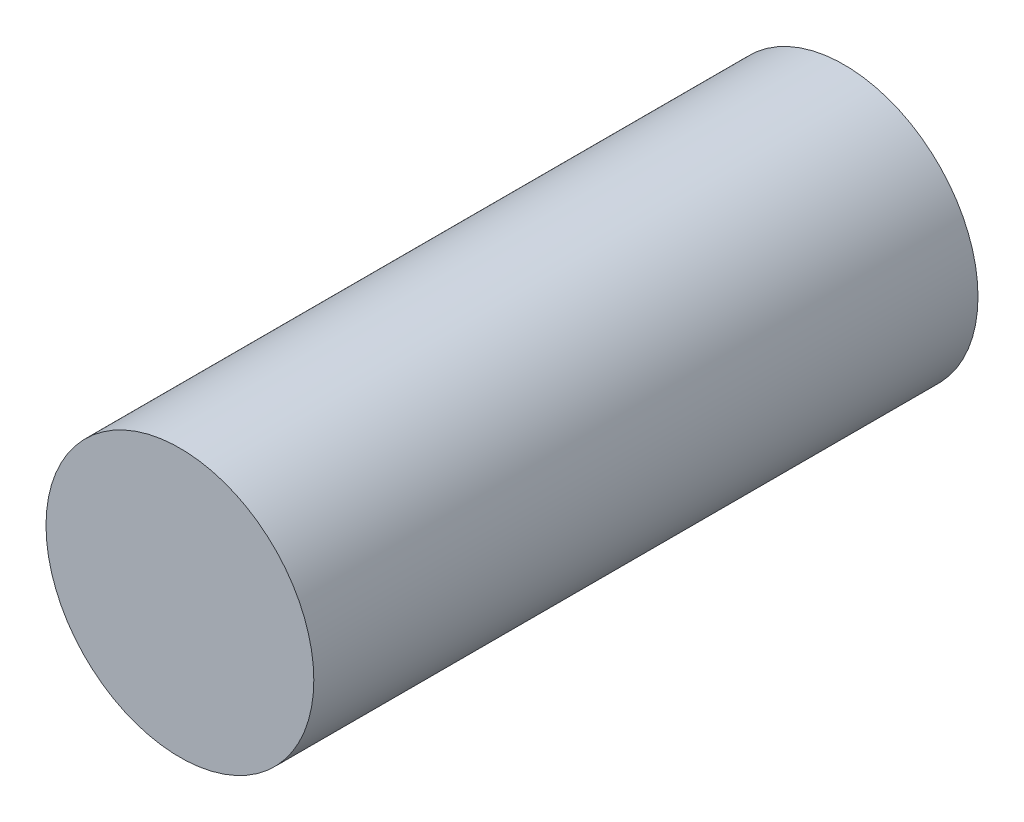
ISO-10303-21;
HEADER;
FILE_DESCRIPTION(('STEP AP214'),'2;1');
FILE_NAME('part.step','',(''),(''),'','','');
FILE_SCHEMA(('AUTOMOTIVE_DESIGN { 1 0 10303 214 1 1 1 1 }'));
ENDSEC;
DATA;
#1=APPLICATION_CONTEXT('core data for automotive mechanical design processes');
#2=APPLICATION_PROTOCOL_DEFINITION('international standard','automotive_design',2000,#1);
#3=PRODUCT_CONTEXT('',#1,'mechanical');
#4=PRODUCT('Part','Part','',(#3));
#5=PRODUCT_RELATED_PRODUCT_CATEGORY('part','',(#4));
#6=PRODUCT_DEFINITION_FORMATION('','',#4);
#7=PRODUCT_DEFINITION_CONTEXT('part definition',#1,'design');
#8=PRODUCT_DEFINITION('design','',#6,#7);
#9=PRODUCT_DEFINITION_SHAPE('','',#8);
#10=(LENGTH_UNIT() NAMED_UNIT(*) SI_UNIT(.MILLI.,.METRE.));
#11=(NAMED_UNIT(*) PLANE_ANGLE_UNIT() SI_UNIT($,.RADIAN.));
#12=(NAMED_UNIT(*) SI_UNIT($,.STERADIAN.) SOLID_ANGLE_UNIT());
#13=UNCERTAINTY_MEASURE_WITH_UNIT(LENGTH_MEASURE(1.E-05),#10,'distance_accuracy_value','');
#14=(GEOMETRIC_REPRESENTATION_CONTEXT(3) GLOBAL_UNCERTAINTY_ASSIGNED_CONTEXT((#13)) GLOBAL_UNIT_ASSIGNED_CONTEXT((#10,
#11,#12)) REPRESENTATION_CONTEXT('',''));
#15=CARTESIAN_POINT('',(0.,0.,0.));
#16=DIRECTION('',(0.,0.,1.));
#17=DIRECTION('',(1.,0.,0.));
#18=AXIS2_PLACEMENT_3D('',#15,#16,#17);
#19=CARTESIAN_POINT('',(17.2319032971318,19.3495426899277,-11.9));
#20=DIRECTION('',(0.,0.,-1.));
#21=DIRECTION('',(-1.,0.,0.));
#22=AXIS2_PLACEMENT_3D('',#19,#20,#21);
#23=PLANE('',#22);
#24=CARTESIAN_POINT('',(0.,0.,-11.9));
#25=DIRECTION('',(0.,0.,-1.));
#26=DIRECTION('',(-1.,0.,0.));
#27=AXIS2_PLACEMENT_3D('',#24,#25,#26);
#28=CIRCLE('',#27,2.5);
#29=CARTESIAN_POINT('',(-2.5,0.,-11.9));
#30=VERTEX_POINT('',#29);
#31=EDGE_CURVE('E10',#30,#30,#28,.F.);
#32=ORIENTED_EDGE('',*,*,#31,.F.);
#33=EDGE_LOOP('',(#32));
#34=FACE_BOUND('',#33,.T.);
#35=ADVANCED_FACE('F29',(#34),#23,.T.);
#36=CARTESIAN_POINT('',(0.,0.,0.5));
#37=DIRECTION('',(0.,0.,1.));
#38=DIRECTION('',(1.,0.,0.));
#39=AXIS2_PLACEMENT_3D('',#36,#37,#38);
#40=PLANE('',#39);
#41=CARTESIAN_POINT('',(0.,0.,0.5));
#42=DIRECTION('',(0.,0.,1.));
#43=DIRECTION('',(1.,0.,0.));
#44=AXIS2_PLACEMENT_3D('',#41,#42,#43);
#45=CIRCLE('',#44,2.5);
#46=CARTESIAN_POINT('',(2.5,0.,0.5));
#47=VERTEX_POINT('',#46);
#48=EDGE_CURVE('E35',#47,#47,#45,.T.);
#49=ORIENTED_EDGE('',*,*,#48,.T.);
#50=EDGE_LOOP('',(#49));
#51=FACE_BOUND('',#50,.T.);
#52=ADVANCED_FACE('F41',(#51),#40,.T.);
#53=CARTESIAN_POINT('',(0.,0.,-18.9710678118655));
#54=DIRECTION('',(0.,0.,1.));
#55=DIRECTION('',(1.,0.,0.));
#56=AXIS2_PLACEMENT_3D('',#53,#54,#55);
#57=CYLINDRICAL_SURFACE('',#56,2.5);
#58=ORIENTED_EDGE('',*,*,#48,.F.);
#59=EDGE_LOOP('',(#58));
#60=FACE_BOUND('',#59,.T.);
#61=ORIENTED_EDGE('',*,*,#31,.T.);
#62=EDGE_LOOP('',(#61));
#63=FACE_BOUND('',#62,.T.);
#64=ADVANCED_FACE('F43',(#60,#63),#57,.T.);
#65=CLOSED_SHELL('',(#35,#52,#64));
#66=MANIFOLD_SOLID_BREP('B2',#65);
#67=ADVANCED_BREP_SHAPE_REPRESENTATION('',(#18,#66),#14);
#68=SHAPE_DEFINITION_REPRESENTATION(#9,#67);
ENDSEC;
END-ISO-10303-21;
